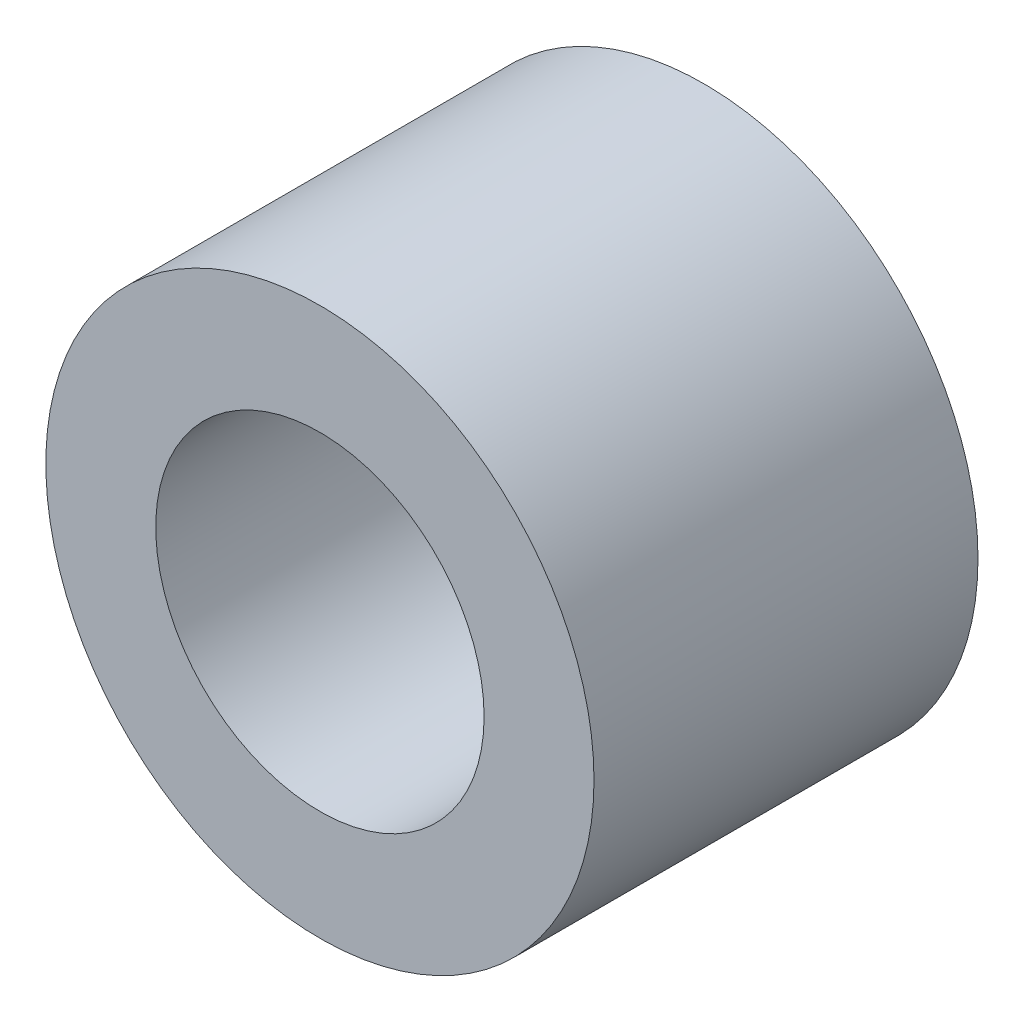
ISO-10303-21;
HEADER;
FILE_DESCRIPTION(('STEP AP214'),'2;1');
FILE_NAME('part.step','',(''),(''),'','','');
FILE_SCHEMA(('AUTOMOTIVE_DESIGN { 1 0 10303 214 1 1 1 1 }'));
ENDSEC;
DATA;
#1=APPLICATION_CONTEXT('core data for automotive mechanical design processes');
#2=APPLICATION_PROTOCOL_DEFINITION('international standard','automotive_design',2000,#1);
#3=PRODUCT_CONTEXT('',#1,'mechanical');
#4=PRODUCT('Part','Part','',(#3));
#5=PRODUCT_RELATED_PRODUCT_CATEGORY('part','',(#4));
#6=PRODUCT_DEFINITION_FORMATION('','',#4);
#7=PRODUCT_DEFINITION_CONTEXT('part definition',#1,'design');
#8=PRODUCT_DEFINITION('design','',#6,#7);
#9=PRODUCT_DEFINITION_SHAPE('','',#8);
#10=(LENGTH_UNIT() NAMED_UNIT(*) SI_UNIT(.MILLI.,.METRE.));
#11=(NAMED_UNIT(*) PLANE_ANGLE_UNIT() SI_UNIT($,.RADIAN.));
#12=(NAMED_UNIT(*) SI_UNIT($,.STERADIAN.) SOLID_ANGLE_UNIT());
#13=UNCERTAINTY_MEASURE_WITH_UNIT(LENGTH_MEASURE(1.E-05),#10,'distance_accuracy_value','');
#14=(GEOMETRIC_REPRESENTATION_CONTEXT(3) GLOBAL_UNCERTAINTY_ASSIGNED_CONTEXT((#13)) GLOBAL_UNIT_ASSIGNED_CONTEXT((#10,
#11,#12)) REPRESENTATION_CONTEXT('',''));
#15=CARTESIAN_POINT('',(0.,0.,0.));
#16=DIRECTION('',(0.,0.,1.));
#17=DIRECTION('',(1.,0.,0.));
#18=AXIS2_PLACEMENT_3D('',#15,#16,#17);
#19=CARTESIAN_POINT('',(0.,0.,3.683));
#20=DIRECTION('',(0.,0.,1.));
#21=DIRECTION('',(1.,0.,0.));
#22=AXIS2_PLACEMENT_3D('',#19,#20,#21);
#23=PLANE('',#22);
#24=CARTESIAN_POINT('',(0.,0.,3.683));
#25=DIRECTION('',(0.,0.,1.));
#26=DIRECTION('',(1.,0.,0.));
#27=AXIS2_PLACEMENT_3D('',#24,#25,#26);
#28=CIRCLE('',#27,2.6289);
#29=CARTESIAN_POINT('',(2.6289,0.,3.683));
#30=VERTEX_POINT('',#29);
#31=EDGE_CURVE('E10',#30,#30,#28,.T.);
#32=ORIENTED_EDGE('',*,*,#31,.T.);
#33=EDGE_LOOP('',(#32));
#34=FACE_BOUND('',#33,.T.);
#35=CARTESIAN_POINT('',(0.,0.,3.683));
#36=DIRECTION('',(0.,0.,1.));
#37=DIRECTION('',(1.,0.,0.));
#38=AXIS2_PLACEMENT_3D('',#35,#36,#37);
#39=CIRCLE('',#38,1.5748);
#40=CARTESIAN_POINT('',(1.5748,0.,3.683));
#41=VERTEX_POINT('',#40);
#42=EDGE_CURVE('E44',#41,#41,#39,.T.);
#43=ORIENTED_EDGE('',*,*,#42,.F.);
#44=EDGE_LOOP('',(#43));
#45=FACE_BOUND('',#44,.T.);
#46=ADVANCED_FACE('F33',(#34,#45),#23,.T.);
#47=CARTESIAN_POINT('',(0.,0.,0.));
#48=DIRECTION('',(0.,0.,1.));
#49=DIRECTION('',(1.,0.,0.));
#50=AXIS2_PLACEMENT_3D('',#47,#48,#49);
#51=PLANE('',#50);
#52=CARTESIAN_POINT('',(0.,0.,0.));
#53=DIRECTION('',(0.,0.,1.));
#54=DIRECTION('',(1.,0.,0.));
#55=AXIS2_PLACEMENT_3D('',#52,#53,#54);
#56=CIRCLE('',#55,2.6289);
#57=CARTESIAN_POINT('',(2.6289,0.,0.));
#58=VERTEX_POINT('',#57);
#59=EDGE_CURVE('E37',#58,#58,#56,.T.);
#60=ORIENTED_EDGE('',*,*,#59,.F.);
#61=EDGE_LOOP('',(#60));
#62=FACE_BOUND('',#61,.T.);
#63=CARTESIAN_POINT('',(0.,0.,0.));
#64=DIRECTION('',(0.,0.,1.));
#65=DIRECTION('',(1.,0.,0.));
#66=AXIS2_PLACEMENT_3D('',#63,#64,#65);
#67=CIRCLE('',#66,1.5748);
#68=CARTESIAN_POINT('',(1.5748,0.,0.));
#69=VERTEX_POINT('',#68);
#70=EDGE_CURVE('E46',#69,#69,#67,.T.);
#71=ORIENTED_EDGE('',*,*,#70,.T.);
#72=EDGE_LOOP('',(#71));
#73=FACE_BOUND('',#72,.T.);
#74=ADVANCED_FACE('F56',(#62,#73),#51,.F.);
#75=CARTESIAN_POINT('',(0.,0.,3.683));
#76=DIRECTION('',(0.,0.,-1.));
#77=DIRECTION('',(-1.,0.,0.));
#78=AXIS2_PLACEMENT_3D('',#75,#76,#77);
#79=CYLINDRICAL_SURFACE('',#78,2.6289);
#80=ORIENTED_EDGE('',*,*,#31,.F.);
#81=EDGE_LOOP('',(#80));
#82=FACE_BOUND('',#81,.T.);
#83=ORIENTED_EDGE('',*,*,#59,.T.);
#84=EDGE_LOOP('',(#83));
#85=FACE_BOUND('',#84,.T.);
#86=ADVANCED_FACE('F35',(#82,#85),#79,.T.);
#87=CARTESIAN_POINT('',(0.,0.,3.683));
#88=DIRECTION('',(0.,0.,-1.));
#89=DIRECTION('',(-1.,0.,0.));
#90=AXIS2_PLACEMENT_3D('',#87,#88,#89);
#91=CYLINDRICAL_SURFACE('',#90,1.5748);
#92=ORIENTED_EDGE('',*,*,#42,.T.);
#93=EDGE_LOOP('',(#92));
#94=FACE_BOUND('',#93,.T.);
#95=ORIENTED_EDGE('',*,*,#70,.F.);
#96=EDGE_LOOP('',(#95));
#97=FACE_BOUND('',#96,.T.);
#98=ADVANCED_FACE('F52',(#94,#97),#91,.F.);
#99=CLOSED_SHELL('',(#46,#74,#86,#98));
#100=MANIFOLD_SOLID_BREP('B2',#99);
#101=ADVANCED_BREP_SHAPE_REPRESENTATION('',(#18,#100),#14);
#102=SHAPE_DEFINITION_REPRESENTATION(#9,#101);
ENDSEC;
END-ISO-10303-21;
